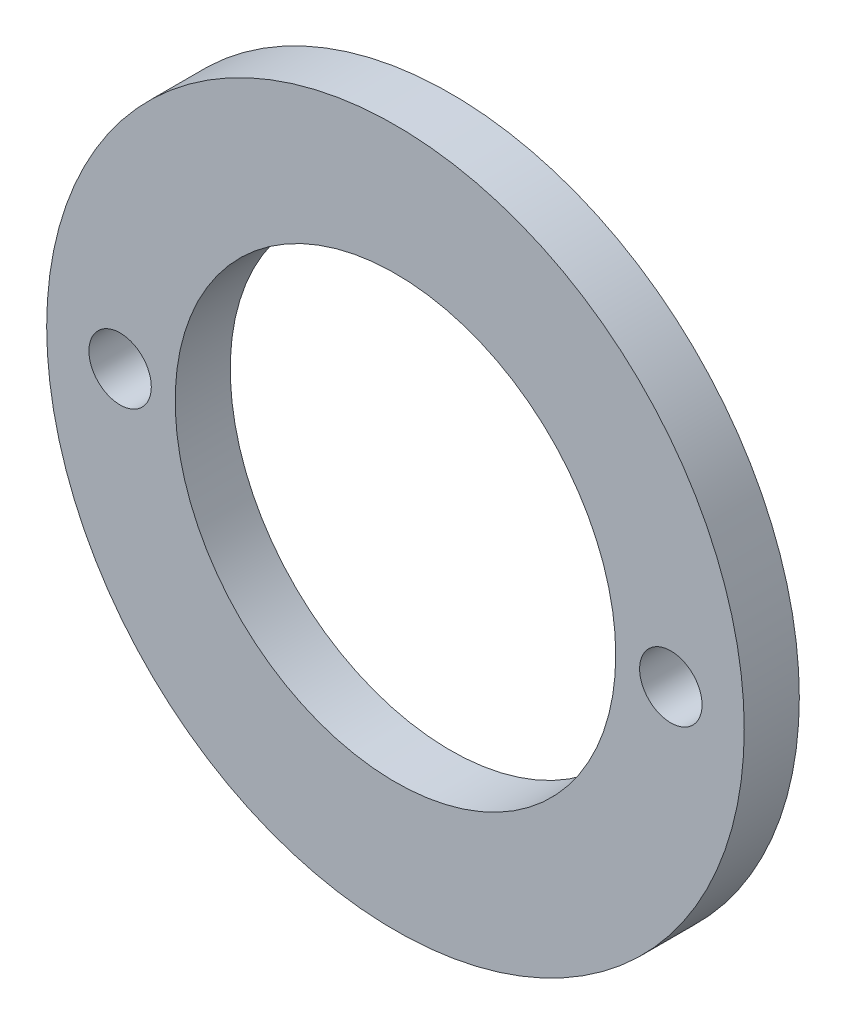
ISO-10303-21;
HEADER;
FILE_DESCRIPTION(('STEP AP214'),'2;1');
FILE_NAME('part.step','',(''),(''),'','','');
FILE_SCHEMA(('AUTOMOTIVE_DESIGN { 1 0 10303 214 1 1 1 1 }'));
ENDSEC;
DATA;
#1=APPLICATION_CONTEXT('core data for automotive mechanical design processes');
#2=APPLICATION_PROTOCOL_DEFINITION('international standard','automotive_design',2000,#1);
#3=PRODUCT_CONTEXT('',#1,'mechanical');
#4=PRODUCT('Part','Part','',(#3));
#5=PRODUCT_RELATED_PRODUCT_CATEGORY('part','',(#4));
#6=PRODUCT_DEFINITION_FORMATION('','',#4);
#7=PRODUCT_DEFINITION_CONTEXT('part definition',#1,'design');
#8=PRODUCT_DEFINITION('design','',#6,#7);
#9=PRODUCT_DEFINITION_SHAPE('','',#8);
#10=(LENGTH_UNIT() NAMED_UNIT(*) SI_UNIT(.MILLI.,.METRE.));
#11=(NAMED_UNIT(*) PLANE_ANGLE_UNIT() SI_UNIT($,.RADIAN.));
#12=(NAMED_UNIT(*) SI_UNIT($,.STERADIAN.) SOLID_ANGLE_UNIT());
#13=UNCERTAINTY_MEASURE_WITH_UNIT(LENGTH_MEASURE(1.E-05),#10,'distance_accuracy_value','');
#14=(GEOMETRIC_REPRESENTATION_CONTEXT(3) GLOBAL_UNCERTAINTY_ASSIGNED_CONTEXT((#13)) GLOBAL_UNIT_ASSIGNED_CONTEXT((#10,
#11,#12)) REPRESENTATION_CONTEXT('',''));
#15=CARTESIAN_POINT('',(0.,0.,0.));
#16=DIRECTION('',(0.,0.,1.));
#17=DIRECTION('',(1.,0.,0.));
#18=AXIS2_PLACEMENT_3D('',#15,#16,#17);
#19=CARTESIAN_POINT('',(672.203091519711,168.981102801537,3.));
#20=DIRECTION('',(0.,0.,-1.));
#21=DIRECTION('',(-1.,0.,0.));
#22=AXIS2_PLACEMENT_3D('',#19,#20,#21);
#23=CYLINDRICAL_SURFACE('',#22,1.69998300000007);
#24=CARTESIAN_POINT('',(672.203091519711,168.981102801537,3.));
#25=DIRECTION('',(0.,0.,1.));
#26=DIRECTION('',(1.,0.,0.));
#27=AXIS2_PLACEMENT_3D('',#24,#25,#26);
#28=CIRCLE('',#27,1.69998300000007);
#29=CARTESIAN_POINT('',(673.903074519711,168.981102801537,3.));
#30=VERTEX_POINT('',#29);
#31=EDGE_CURVE('E42',#30,#30,#28,.T.);
#32=ORIENTED_EDGE('',*,*,#31,.T.);
#33=EDGE_LOOP('',(#32));
#34=FACE_BOUND('',#33,.T.);
#35=CARTESIAN_POINT('',(672.203091519711,168.981102801537,0.));
#36=DIRECTION('',(0.,0.,1.));
#37=DIRECTION('',(1.,0.,0.));
#38=AXIS2_PLACEMENT_3D('',#35,#36,#37);
#39=CIRCLE('',#38,1.69998300000007);
#40=CARTESIAN_POINT('',(673.903074519711,168.981102801537,0.));
#41=VERTEX_POINT('',#40);
#42=EDGE_CURVE('E56',#41,#41,#39,.T.);
#43=ORIENTED_EDGE('',*,*,#42,.F.);
#44=EDGE_LOOP('',(#43));
#45=FACE_BOUND('',#44,.T.);
#46=ADVANCED_FACE('F34',(#34,#45),#23,.F.);
#47=CARTESIAN_POINT('',(657.203241519778,168.981102801537,3.));
#48=DIRECTION('',(0.,0.,-1.));
#49=DIRECTION('',(-1.,0.,0.));
#50=AXIS2_PLACEMENT_3D('',#47,#48,#49);
#51=CYLINDRICAL_SURFACE('',#50,12.0000000000001);
#52=CARTESIAN_POINT('',(657.203241519778,168.981102801537,3.));
#53=DIRECTION('',(0.,0.,1.));
#54=DIRECTION('',(1.,0.,0.));
#55=AXIS2_PLACEMENT_3D('',#52,#53,#54);
#56=CIRCLE('',#55,12.0000000000001);
#57=CARTESIAN_POINT('',(669.203241519778,168.981102801537,3.));
#58=VERTEX_POINT('',#57);
#59=EDGE_CURVE('E47',#58,#58,#56,.T.);
#60=ORIENTED_EDGE('',*,*,#59,.T.);
#61=EDGE_LOOP('',(#60));
#62=FACE_BOUND('',#61,.T.);
#63=CARTESIAN_POINT('',(657.203241519778,168.981102801537,0.));
#64=DIRECTION('',(0.,0.,1.));
#65=DIRECTION('',(1.,0.,0.));
#66=AXIS2_PLACEMENT_3D('',#63,#64,#65);
#67=CIRCLE('',#66,12.0000000000001);
#68=CARTESIAN_POINT('',(669.203241519778,168.981102801537,0.));
#69=VERTEX_POINT('',#68);
#70=EDGE_CURVE('E54',#69,#69,#67,.T.);
#71=ORIENTED_EDGE('',*,*,#70,.F.);
#72=EDGE_LOOP('',(#71));
#73=FACE_BOUND('',#72,.T.);
#74=ADVANCED_FACE('F71',(#62,#73),#51,.F.);
#75=CARTESIAN_POINT('',(642.203391519778,168.981102801537,3.));
#76=DIRECTION('',(0.,0.,-1.));
#77=DIRECTION('',(-1.,0.,0.));
#78=AXIS2_PLACEMENT_3D('',#75,#76,#77);
#79=CYLINDRICAL_SURFACE('',#78,1.69998300000007);
#80=CARTESIAN_POINT('',(642.203391519778,168.981102801537,3.));
#81=DIRECTION('',(0.,0.,1.));
#82=DIRECTION('',(1.,0.,0.));
#83=AXIS2_PLACEMENT_3D('',#80,#81,#82);
#84=CIRCLE('',#83,1.69998300000007);
#85=CARTESIAN_POINT('',(643.903374519778,168.981102801537,3.));
#86=VERTEX_POINT('',#85);
#87=EDGE_CURVE('E61',#86,#86,#84,.T.);
#88=ORIENTED_EDGE('',*,*,#87,.T.);
#89=EDGE_LOOP('',(#88));
#90=FACE_BOUND('',#89,.T.);
#91=CARTESIAN_POINT('',(642.203391519778,168.981102801537,0.));
#92=DIRECTION('',(0.,0.,1.));
#93=DIRECTION('',(1.,0.,0.));
#94=AXIS2_PLACEMENT_3D('',#91,#92,#93);
#95=CIRCLE('',#94,1.69998300000007);
#96=CARTESIAN_POINT('',(643.903374519778,168.981102801537,0.));
#97=VERTEX_POINT('',#96);
#98=EDGE_CURVE('E51',#97,#97,#95,.T.);
#99=ORIENTED_EDGE('',*,*,#98,.F.);
#100=EDGE_LOOP('',(#99));
#101=FACE_BOUND('',#100,.T.);
#102=ADVANCED_FACE('F36',(#90,#101),#79,.F.);
#103=CARTESIAN_POINT('',(657.203241519778,168.981102801537,3.));
#104=DIRECTION('',(0.,0.,-1.));
#105=DIRECTION('',(-1.,0.,0.));
#106=AXIS2_PLACEMENT_3D('',#103,#104,#105);
#107=CYLINDRICAL_SURFACE('',#106,18.9999999999999);
#108=CARTESIAN_POINT('',(657.203241519778,168.981102801537,3.));
#109=DIRECTION('',(0.,0.,1.));
#110=DIRECTION('',(1.,0.,0.));
#111=AXIS2_PLACEMENT_3D('',#108,#109,#110);
#112=CIRCLE('',#111,18.9999999999999);
#113=CARTESIAN_POINT('',(676.203241519778,168.981102801537,3.));
#114=VERTEX_POINT('',#113);
#115=EDGE_CURVE('E10',#114,#114,#112,.T.);
#116=ORIENTED_EDGE('',*,*,#115,.F.);
#117=EDGE_LOOP('',(#116));
#118=FACE_BOUND('',#117,.T.);
#119=CARTESIAN_POINT('',(657.203241519778,168.981102801537,0.));
#120=DIRECTION('',(0.,0.,1.));
#121=DIRECTION('',(1.,0.,0.));
#122=AXIS2_PLACEMENT_3D('',#119,#120,#121);
#123=CIRCLE('',#122,18.9999999999999);
#124=CARTESIAN_POINT('',(676.203241519778,168.981102801537,0.));
#125=VERTEX_POINT('',#124);
#126=EDGE_CURVE('E38',#125,#125,#123,.T.);
#127=ORIENTED_EDGE('',*,*,#126,.T.);
#128=EDGE_LOOP('',(#127));
#129=FACE_BOUND('',#128,.T.);
#130=ADVANCED_FACE('F78',(#118,#129),#107,.T.);
#131=CARTESIAN_POINT('',(0.,0.,3.));
#132=DIRECTION('',(0.,0.,1.));
#133=DIRECTION('',(1.,0.,0.));
#134=AXIS2_PLACEMENT_3D('',#131,#132,#133);
#135=PLANE('',#134);
#136=ORIENTED_EDGE('',*,*,#87,.F.);
#137=EDGE_LOOP('',(#136));
#138=FACE_BOUND('',#137,.T.);
#139=ORIENTED_EDGE('',*,*,#59,.F.);
#140=EDGE_LOOP('',(#139));
#141=FACE_BOUND('',#140,.T.);
#142=ORIENTED_EDGE('',*,*,#31,.F.);
#143=EDGE_LOOP('',(#142));
#144=FACE_BOUND('',#143,.T.);
#145=ORIENTED_EDGE('',*,*,#115,.T.);
#146=EDGE_LOOP('',(#145));
#147=FACE_BOUND('',#146,.T.);
#148=ADVANCED_FACE('F74',(#138,#141,#144,#147),#135,.T.);
#149=CARTESIAN_POINT('',(0.,0.,0.));
#150=DIRECTION('',(0.,0.,1.));
#151=DIRECTION('',(1.,0.,0.));
#152=AXIS2_PLACEMENT_3D('',#149,#150,#151);
#153=PLANE('',#152);
#154=ORIENTED_EDGE('',*,*,#98,.T.);
#155=EDGE_LOOP('',(#154));
#156=FACE_BOUND('',#155,.T.);
#157=ORIENTED_EDGE('',*,*,#70,.T.);
#158=EDGE_LOOP('',(#157));
#159=FACE_BOUND('',#158,.T.);
#160=ORIENTED_EDGE('',*,*,#42,.T.);
#161=EDGE_LOOP('',(#160));
#162=FACE_BOUND('',#161,.T.);
#163=ORIENTED_EDGE('',*,*,#126,.F.);
#164=EDGE_LOOP('',(#163));
#165=FACE_BOUND('',#164,.T.);
#166=ADVANCED_FACE('F77',(#156,#159,#162,#165),#153,.F.);
#167=CLOSED_SHELL('',(#46,#74,#102,#130,#148,#166));
#168=MANIFOLD_SOLID_BREP('B2',#167);
#169=ADVANCED_BREP_SHAPE_REPRESENTATION('',(#18,#168),#14);
#170=SHAPE_DEFINITION_REPRESENTATION(#9,#169);
ENDSEC;
END-ISO-10303-21;
